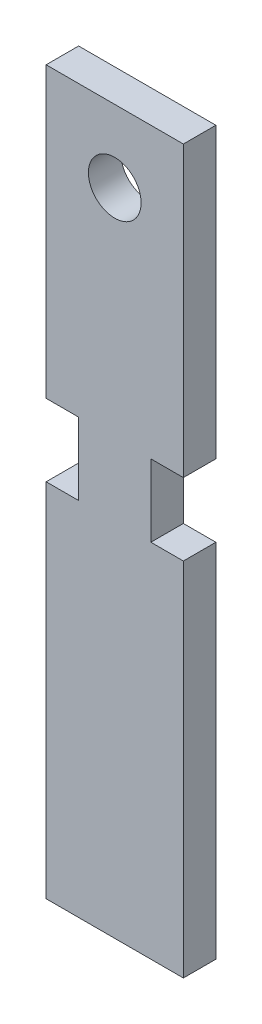
ISO-10303-21;
HEADER;
FILE_DESCRIPTION(('STEP AP214'),'2;1');
FILE_NAME('part.step','',(''),(''),'','','');
FILE_SCHEMA(('AUTOMOTIVE_DESIGN { 1 0 10303 214 1 1 1 1 }'));
ENDSEC;
DATA;
#1=APPLICATION_CONTEXT('core data for automotive mechanical design processes');
#2=APPLICATION_PROTOCOL_DEFINITION('international standard','automotive_design',2000,#1);
#3=PRODUCT_CONTEXT('',#1,'mechanical');
#4=PRODUCT('Part','Part','',(#3));
#5=PRODUCT_RELATED_PRODUCT_CATEGORY('part','',(#4));
#6=PRODUCT_DEFINITION_FORMATION('','',#4);
#7=PRODUCT_DEFINITION_CONTEXT('part definition',#1,'design');
#8=PRODUCT_DEFINITION('design','',#6,#7);
#9=PRODUCT_DEFINITION_SHAPE('','',#8);
#10=(LENGTH_UNIT() NAMED_UNIT(*) SI_UNIT(.MILLI.,.METRE.));
#11=(NAMED_UNIT(*) PLANE_ANGLE_UNIT() SI_UNIT($,.RADIAN.));
#12=(NAMED_UNIT(*) SI_UNIT($,.STERADIAN.) SOLID_ANGLE_UNIT());
#13=UNCERTAINTY_MEASURE_WITH_UNIT(LENGTH_MEASURE(1.E-05),#10,'distance_accuracy_value','');
#14=(GEOMETRIC_REPRESENTATION_CONTEXT(3) GLOBAL_UNCERTAINTY_ASSIGNED_CONTEXT((#13)) GLOBAL_UNIT_ASSIGNED_CONTEXT((#10,
#11,#12)) REPRESENTATION_CONTEXT('',''));
#15=CARTESIAN_POINT('',(0.,0.,0.));
#16=DIRECTION('',(0.,0.,1.));
#17=DIRECTION('',(1.,0.,0.));
#18=AXIS2_PLACEMENT_3D('',#15,#16,#17);
#19=CARTESIAN_POINT('',(-25.4,63.5,5.715));
#20=DIRECTION('',(0.,-1.,0.));
#21=DIRECTION('',(1.,0.,0.));
#22=AXIS2_PLACEMENT_3D('',#19,#20,#21);
#23=PLANE('',#22);
#24=DIRECTION('',(0.,0.,1.));
#25=VECTOR('',#24,1.);
#26=CARTESIAN_POINT('',(-12.065,63.5,0.));
#27=LINE('',#26,#25);
#28=CARTESIAN_POINT('',(-12.065,63.5,0.));
#29=VERTEX_POINT('',#28);
#30=CARTESIAN_POINT('',(-12.065,63.5,5.715));
#31=VERTEX_POINT('',#30);
#32=EDGE_CURVE('E135',#29,#31,#27,.T.);
#33=ORIENTED_EDGE('',*,*,#32,.T.);
#34=DIRECTION('',(-1.,0.,0.));
#35=VECTOR('',#34,1.);
#36=CARTESIAN_POINT('',(-25.4,63.5,5.715));
#37=LINE('',#36,#35);
#38=CARTESIAN_POINT('',(12.065,63.5,5.715));
#39=VERTEX_POINT('',#38);
#40=EDGE_CURVE('E54',#39,#31,#37,.T.);
#41=ORIENTED_EDGE('',*,*,#40,.F.);
#42=DIRECTION('',(0.,0.,1.));
#43=VECTOR('',#42,1.);
#44=CARTESIAN_POINT('',(12.065,63.5,0.));
#45=LINE('',#44,#43);
#46=CARTESIAN_POINT('',(12.065,63.5,0.));
#47=VERTEX_POINT('',#46);
#48=EDGE_CURVE('E163',#47,#39,#45,.T.);
#49=ORIENTED_EDGE('',*,*,#48,.F.);
#50=DIRECTION('',(-1.,0.,0.));
#51=VECTOR('',#50,1.);
#52=CARTESIAN_POINT('',(-25.4,63.5,0.));
#53=LINE('',#52,#51);
#54=EDGE_CURVE('E155',#47,#29,#53,.T.);
#55=ORIENTED_EDGE('',*,*,#54,.T.);
#56=EDGE_LOOP('',(#33,#41,#49,#55));
#57=FACE_BOUND('',#56,.T.);
#58=ADVANCED_FACE('F45',(#57),#23,.F.);
#59=CARTESIAN_POINT('',(-25.4,-63.5,5.715));
#60=DIRECTION('',(0.,1.,0.));
#61=DIRECTION('',(-1.,0.,0.));
#62=AXIS2_PLACEMENT_3D('',#59,#60,#61);
#63=PLANE('',#62);
#64=DIRECTION('',(0.,0.,1.));
#65=VECTOR('',#64,1.);
#66=CARTESIAN_POINT('',(-12.065,-63.5,0.));
#67=LINE('',#66,#65);
#68=CARTESIAN_POINT('',(-12.065,-63.5,0.));
#69=VERTEX_POINT('',#68);
#70=CARTESIAN_POINT('',(-12.065,-63.5,5.715));
#71=VERTEX_POINT('',#70);
#72=EDGE_CURVE('E147',#69,#71,#67,.T.);
#73=ORIENTED_EDGE('',*,*,#72,.F.);
#74=DIRECTION('',(1.,0.,0.));
#75=VECTOR('',#74,1.);
#76=CARTESIAN_POINT('',(-25.4,-63.5,0.));
#77=LINE('',#76,#75);
#78=CARTESIAN_POINT('',(12.065,-63.5,0.));
#79=VERTEX_POINT('',#78);
#80=EDGE_CURVE('E48',#69,#79,#77,.T.);
#81=ORIENTED_EDGE('',*,*,#80,.T.);
#82=DIRECTION('',(0.,0.,1.));
#83=VECTOR('',#82,1.);
#84=CARTESIAN_POINT('',(12.065,-63.5,0.));
#85=LINE('',#84,#83);
#86=CARTESIAN_POINT('',(12.065,-63.5,5.715));
#87=VERTEX_POINT('',#86);
#88=EDGE_CURVE('E250',#79,#87,#85,.T.);
#89=ORIENTED_EDGE('',*,*,#88,.T.);
#90=DIRECTION('',(1.,0.,0.));
#91=VECTOR('',#90,1.);
#92=CARTESIAN_POINT('',(-25.4,-63.5,5.715));
#93=LINE('',#92,#91);
#94=EDGE_CURVE('E11',#71,#87,#93,.T.);
#95=ORIENTED_EDGE('',*,*,#94,.F.);
#96=EDGE_LOOP('',(#73,#81,#89,#95));
#97=FACE_BOUND('',#96,.T.);
#98=ADVANCED_FACE('F281',(#97),#63,.F.);
#99=CARTESIAN_POINT('',(0.,0.,5.715));
#100=DIRECTION('',(0.,0.,-1.));
#101=DIRECTION('',(-1.,0.,0.));
#102=AXIS2_PLACEMENT_3D('',#99,#100,#101);
#103=PLANE('',#102);
#104=CARTESIAN_POINT('',(0.,50.8,5.715));
#105=DIRECTION('',(0.,0.,1.));
#106=DIRECTION('',(1.,0.,0.));
#107=AXIS2_PLACEMENT_3D('',#104,#105,#106);
#108=CIRCLE('',#107,4.6355);
#109=CARTESIAN_POINT('',(4.6355,50.8,5.715));
#110=VERTEX_POINT('',#109);
#111=EDGE_CURVE('E172',#110,#110,#108,.T.);
#112=ORIENTED_EDGE('',*,*,#111,.F.);
#113=EDGE_LOOP('',(#112));
#114=FACE_BOUND('',#113,.T.);
#115=DIRECTION('',(0.,-1.,0.));
#116=VECTOR('',#115,1.);
#117=CARTESIAN_POINT('',(-12.065,0.,5.715));
#118=LINE('',#117,#116);
#119=CARTESIAN_POINT('',(-12.065,0.,5.715));
#120=VERTEX_POINT('',#119);
#121=EDGE_CURVE('E255',#120,#71,#118,.T.);
#122=ORIENTED_EDGE('',*,*,#121,.T.);
#123=ORIENTED_EDGE('',*,*,#94,.T.);
#124=DIRECTION('',(0.,-1.,0.));
#125=VECTOR('',#124,1.);
#126=CARTESIAN_POINT('',(12.065,0.,5.715));
#127=LINE('',#126,#125);
#128=CARTESIAN_POINT('',(12.065,0.,5.715));
#129=VERTEX_POINT('',#128);
#130=EDGE_CURVE('E259',#129,#87,#127,.T.);
#131=ORIENTED_EDGE('',*,*,#130,.F.);
#132=DIRECTION('',(1.,0.,0.));
#133=VECTOR('',#132,1.);
#134=CARTESIAN_POINT('',(12.065,0.,5.715));
#135=LINE('',#134,#133);
#136=CARTESIAN_POINT('',(6.34999999999999,0.,5.715));
#137=VERTEX_POINT('',#136);
#138=EDGE_CURVE('E181',#137,#129,#135,.T.);
#139=ORIENTED_EDGE('',*,*,#138,.F.);
#140=DIRECTION('',(0.,-1.,0.));
#141=VECTOR('',#140,1.);
#142=CARTESIAN_POINT('',(6.34999999999999,0.,5.715));
#143=LINE('',#142,#141);
#144=CARTESIAN_POINT('',(6.34999999999999,12.7,5.715));
#145=VERTEX_POINT('',#144);
#146=EDGE_CURVE('E196',#145,#137,#143,.T.);
#147=ORIENTED_EDGE('',*,*,#146,.F.);
#148=DIRECTION('',(-1.,0.,0.));
#149=VECTOR('',#148,1.);
#150=CARTESIAN_POINT('',(12.065,12.7,5.715));
#151=LINE('',#150,#149);
#152=CARTESIAN_POINT('',(12.065,12.7,5.715));
#153=VERTEX_POINT('',#152);
#154=EDGE_CURVE('E191',#153,#145,#151,.T.);
#155=ORIENTED_EDGE('',*,*,#154,.F.);
#156=EDGE_CURVE('E70',#39,#153,#127,.T.);
#157=ORIENTED_EDGE('',*,*,#156,.F.);
#158=ORIENTED_EDGE('',*,*,#40,.T.);
#159=CARTESIAN_POINT('',(-12.065,12.7,5.715));
#160=VERTEX_POINT('',#159);
#161=EDGE_CURVE('E141',#31,#160,#118,.T.);
#162=ORIENTED_EDGE('',*,*,#161,.T.);
#163=DIRECTION('',(-1.,0.,0.));
#164=VECTOR('',#163,1.);
#165=CARTESIAN_POINT('',(-12.065,12.7,5.715));
#166=LINE('',#165,#164);
#167=CARTESIAN_POINT('',(-6.34999999999999,12.7,5.715));
#168=VERTEX_POINT('',#167);
#169=EDGE_CURVE('E227',#168,#160,#166,.T.);
#170=ORIENTED_EDGE('',*,*,#169,.F.);
#171=DIRECTION('',(0.,1.,0.));
#172=VECTOR('',#171,1.);
#173=CARTESIAN_POINT('',(-6.34999999999999,0.,5.715));
#174=LINE('',#173,#172);
#175=CARTESIAN_POINT('',(-6.34999999999999,0.,5.715));
#176=VERTEX_POINT('',#175);
#177=EDGE_CURVE('E62',#176,#168,#174,.T.);
#178=ORIENTED_EDGE('',*,*,#177,.F.);
#179=DIRECTION('',(1.,0.,0.));
#180=VECTOR('',#179,1.);
#181=CARTESIAN_POINT('',(-12.065,0.,5.715));
#182=LINE('',#181,#180);
#183=EDGE_CURVE('E217',#120,#176,#182,.T.);
#184=ORIENTED_EDGE('',*,*,#183,.F.);
#185=EDGE_LOOP('',(#122,#123,#131,#139,#147,#155,#157,#158,#162,#170,#178,#184));
#186=FACE_BOUND('',#185,.T.);
#187=ADVANCED_FACE('F276',(#114,#186),#103,.F.);
#188=CARTESIAN_POINT('',(0.,0.,0.));
#189=DIRECTION('',(0.,0.,-1.));
#190=DIRECTION('',(-1.,0.,0.));
#191=AXIS2_PLACEMENT_3D('',#188,#189,#190);
#192=PLANE('',#191);
#193=CARTESIAN_POINT('',(0.,50.8,0.));
#194=DIRECTION('',(0.,0.,1.));
#195=DIRECTION('',(1.,0.,0.));
#196=AXIS2_PLACEMENT_3D('',#193,#194,#195);
#197=CIRCLE('',#196,4.6355);
#198=CARTESIAN_POINT('',(4.6355,50.8,0.));
#199=VERTEX_POINT('',#198);
#200=EDGE_CURVE('E165',#199,#199,#197,.T.);
#201=ORIENTED_EDGE('',*,*,#200,.T.);
#202=EDGE_LOOP('',(#201));
#203=FACE_BOUND('',#202,.T.);
#204=ORIENTED_EDGE('',*,*,#80,.F.);
#205=DIRECTION('',(0.,-1.,0.));
#206=VECTOR('',#205,1.);
#207=CARTESIAN_POINT('',(-12.065,0.,0.));
#208=LINE('',#207,#206);
#209=CARTESIAN_POINT('',(-12.065,0.,0.));
#210=VERTEX_POINT('',#209);
#211=EDGE_CURVE('E160',#210,#69,#208,.T.);
#212=ORIENTED_EDGE('',*,*,#211,.F.);
#213=DIRECTION('',(1.,0.,0.));
#214=VECTOR('',#213,1.);
#215=CARTESIAN_POINT('',(-12.065,0.,0.));
#216=LINE('',#215,#214);
#217=CARTESIAN_POINT('',(-6.34999999999999,0.,0.));
#218=VERTEX_POINT('',#217);
#219=EDGE_CURVE('E220',#210,#218,#216,.T.);
#220=ORIENTED_EDGE('',*,*,#219,.T.);
#221=DIRECTION('',(0.,1.,0.));
#222=VECTOR('',#221,1.);
#223=CARTESIAN_POINT('',(-6.34999999999999,0.,0.));
#224=LINE('',#223,#222);
#225=CARTESIAN_POINT('',(-6.34999999999999,12.7,0.));
#226=VERTEX_POINT('',#225);
#227=EDGE_CURVE('E214',#218,#226,#224,.T.);
#228=ORIENTED_EDGE('',*,*,#227,.T.);
#229=DIRECTION('',(-1.,0.,0.));
#230=VECTOR('',#229,1.);
#231=CARTESIAN_POINT('',(-12.065,12.7,0.));
#232=LINE('',#231,#230);
#233=CARTESIAN_POINT('',(-12.065,12.7,0.));
#234=VERTEX_POINT('',#233);
#235=EDGE_CURVE('E158',#226,#234,#232,.T.);
#236=ORIENTED_EDGE('',*,*,#235,.T.);
#237=EDGE_CURVE('E138',#29,#234,#208,.T.);
#238=ORIENTED_EDGE('',*,*,#237,.F.);
#239=ORIENTED_EDGE('',*,*,#54,.F.);
#240=DIRECTION('',(0.,-1.,0.));
#241=VECTOR('',#240,1.);
#242=CARTESIAN_POINT('',(12.065,0.,0.));
#243=LINE('',#242,#241);
#244=CARTESIAN_POINT('',(12.065,12.7,0.));
#245=VERTEX_POINT('',#244);
#246=EDGE_CURVE('E251',#47,#245,#243,.T.);
#247=ORIENTED_EDGE('',*,*,#246,.T.);
#248=DIRECTION('',(-1.,0.,0.));
#249=VECTOR('',#248,1.);
#250=CARTESIAN_POINT('',(12.065,12.7,0.));
#251=LINE('',#250,#249);
#252=CARTESIAN_POINT('',(6.34999999999999,12.7,0.));
#253=VERTEX_POINT('',#252);
#254=EDGE_CURVE('E177',#245,#253,#251,.T.);
#255=ORIENTED_EDGE('',*,*,#254,.T.);
#256=DIRECTION('',(0.,-1.,0.));
#257=VECTOR('',#256,1.);
#258=CARTESIAN_POINT('',(6.34999999999999,0.,0.));
#259=LINE('',#258,#257);
#260=CARTESIAN_POINT('',(6.34999999999999,0.,0.));
#261=VERTEX_POINT('',#260);
#262=EDGE_CURVE('E182',#253,#261,#259,.T.);
#263=ORIENTED_EDGE('',*,*,#262,.T.);
#264=DIRECTION('',(1.,0.,0.));
#265=VECTOR('',#264,1.);
#266=CARTESIAN_POINT('',(12.065,0.,0.));
#267=LINE('',#266,#265);
#268=CARTESIAN_POINT('',(12.065,0.,0.));
#269=VERTEX_POINT('',#268);
#270=EDGE_CURVE('E186',#261,#269,#267,.T.);
#271=ORIENTED_EDGE('',*,*,#270,.T.);
#272=EDGE_CURVE('E258',#269,#79,#243,.T.);
#273=ORIENTED_EDGE('',*,*,#272,.T.);
#274=EDGE_LOOP('',(#204,#212,#220,#228,#236,#238,#239,#247,#255,#263,#271,#273));
#275=FACE_BOUND('',#274,.T.);
#276=ADVANCED_FACE('F153',(#203,#275),#192,.T.);
#277=CARTESIAN_POINT('',(12.065,0.,0.));
#278=DIRECTION('',(0.,-1.,0.));
#279=DIRECTION('',(0.,0.,-1.));
#280=AXIS2_PLACEMENT_3D('',#277,#278,#279);
#281=PLANE('',#280);
#282=ORIENTED_EDGE('',*,*,#138,.T.);
#283=DIRECTION('',(0.,0.,1.));
#284=VECTOR('',#283,1.);
#285=CARTESIAN_POINT('',(12.065,0.,0.));
#286=LINE('',#285,#284);
#287=EDGE_CURVE('E203',#269,#129,#286,.T.);
#288=ORIENTED_EDGE('',*,*,#287,.F.);
#289=ORIENTED_EDGE('',*,*,#270,.F.);
#290=DIRECTION('',(0.,0.,1.));
#291=VECTOR('',#290,1.);
#292=CARTESIAN_POINT('',(6.34999999999999,0.,0.));
#293=LINE('',#292,#291);
#294=EDGE_CURVE('E206',#261,#137,#293,.T.);
#295=ORIENTED_EDGE('',*,*,#294,.T.);
#296=EDGE_LOOP('',(#282,#288,#289,#295));
#297=FACE_BOUND('',#296,.T.);
#298=ADVANCED_FACE('F361',(#297),#281,.F.);
#299=CARTESIAN_POINT('',(6.34999999999999,0.,0.));
#300=DIRECTION('',(-1.,0.,0.));
#301=DIRECTION('',(0.,0.,1.));
#302=AXIS2_PLACEMENT_3D('',#299,#300,#301);
#303=PLANE('',#302);
#304=ORIENTED_EDGE('',*,*,#146,.T.);
#305=ORIENTED_EDGE('',*,*,#294,.F.);
#306=ORIENTED_EDGE('',*,*,#262,.F.);
#307=DIRECTION('',(0.,0.,1.));
#308=VECTOR('',#307,1.);
#309=CARTESIAN_POINT('',(6.34999999999999,12.7,0.));
#310=LINE('',#309,#308);
#311=EDGE_CURVE('E209',#253,#145,#310,.T.);
#312=ORIENTED_EDGE('',*,*,#311,.T.);
#313=EDGE_LOOP('',(#304,#305,#306,#312));
#314=FACE_BOUND('',#313,.T.);
#315=ADVANCED_FACE('F366',(#314),#303,.F.);
#316=CARTESIAN_POINT('',(12.065,12.7,0.));
#317=DIRECTION('',(0.,1.,0.));
#318=DIRECTION('',(0.,0.,1.));
#319=AXIS2_PLACEMENT_3D('',#316,#317,#318);
#320=PLANE('',#319);
#321=ORIENTED_EDGE('',*,*,#154,.T.);
#322=ORIENTED_EDGE('',*,*,#311,.F.);
#323=ORIENTED_EDGE('',*,*,#254,.F.);
#324=DIRECTION('',(0.,0.,1.));
#325=VECTOR('',#324,1.);
#326=CARTESIAN_POINT('',(12.065,12.7,0.));
#327=LINE('',#326,#325);
#328=EDGE_CURVE('E190',#245,#153,#327,.T.);
#329=ORIENTED_EDGE('',*,*,#328,.T.);
#330=EDGE_LOOP('',(#321,#322,#323,#329));
#331=FACE_BOUND('',#330,.T.);
#332=ADVANCED_FACE('F370',(#331),#320,.F.);
#333=CARTESIAN_POINT('',(-6.34999999999999,0.,0.));
#334=DIRECTION('',(1.,0.,0.));
#335=DIRECTION('',(0.,0.,-1.));
#336=AXIS2_PLACEMENT_3D('',#333,#334,#335);
#337=PLANE('',#336);
#338=ORIENTED_EDGE('',*,*,#177,.T.);
#339=DIRECTION('',(0.,0.,1.));
#340=VECTOR('',#339,1.);
#341=CARTESIAN_POINT('',(-6.34999999999999,12.7,0.));
#342=LINE('',#341,#340);
#343=EDGE_CURVE('E224',#226,#168,#342,.T.);
#344=ORIENTED_EDGE('',*,*,#343,.F.);
#345=ORIENTED_EDGE('',*,*,#227,.F.);
#346=DIRECTION('',(0.,0.,1.));
#347=VECTOR('',#346,1.);
#348=CARTESIAN_POINT('',(-6.34999999999999,0.,0.));
#349=LINE('',#348,#347);
#350=EDGE_CURVE('E195',#218,#176,#349,.T.);
#351=ORIENTED_EDGE('',*,*,#350,.T.);
#352=EDGE_LOOP('',(#338,#344,#345,#351));
#353=FACE_BOUND('',#352,.T.);
#354=ADVANCED_FACE('F400',(#353),#337,.F.);
#355=CARTESIAN_POINT('',(-12.065,0.,0.));
#356=DIRECTION('',(0.,-1.,0.));
#357=DIRECTION('',(0.,0.,-1.));
#358=AXIS2_PLACEMENT_3D('',#355,#356,#357);
#359=PLANE('',#358);
#360=ORIENTED_EDGE('',*,*,#183,.T.);
#361=ORIENTED_EDGE('',*,*,#350,.F.);
#362=ORIENTED_EDGE('',*,*,#219,.F.);
#363=DIRECTION('',(0.,0.,1.));
#364=VECTOR('',#363,1.);
#365=CARTESIAN_POINT('',(-12.065,0.,0.));
#366=LINE('',#365,#364);
#367=EDGE_CURVE('E236',#210,#120,#366,.T.);
#368=ORIENTED_EDGE('',*,*,#367,.T.);
#369=EDGE_LOOP('',(#360,#361,#362,#368));
#370=FACE_BOUND('',#369,.T.);
#371=ADVANCED_FACE('F401',(#370),#359,.F.);
#372=CARTESIAN_POINT('',(-12.065,12.7,0.));
#373=DIRECTION('',(0.,1.,0.));
#374=DIRECTION('',(0.,0.,1.));
#375=AXIS2_PLACEMENT_3D('',#372,#373,#374);
#376=PLANE('',#375);
#377=ORIENTED_EDGE('',*,*,#169,.T.);
#378=DIRECTION('',(0.,0.,1.));
#379=VECTOR('',#378,1.);
#380=CARTESIAN_POINT('',(-12.065,12.7,0.));
#381=LINE('',#380,#379);
#382=EDGE_CURVE('E240',#234,#160,#381,.T.);
#383=ORIENTED_EDGE('',*,*,#382,.F.);
#384=ORIENTED_EDGE('',*,*,#235,.F.);
#385=ORIENTED_EDGE('',*,*,#343,.T.);
#386=EDGE_LOOP('',(#377,#383,#384,#385));
#387=FACE_BOUND('',#386,.T.);
#388=ADVANCED_FACE('F404',(#387),#376,.F.);
#389=CARTESIAN_POINT('',(0.,50.8,0.));
#390=DIRECTION('',(0.,0.,1.));
#391=DIRECTION('',(1.,0.,0.));
#392=AXIS2_PLACEMENT_3D('',#389,#390,#391);
#393=CYLINDRICAL_SURFACE('',#392,4.6355);
#394=ORIENTED_EDGE('',*,*,#200,.F.);
#395=EDGE_LOOP('',(#394));
#396=FACE_BOUND('',#395,.T.);
#397=ORIENTED_EDGE('',*,*,#111,.T.);
#398=EDGE_LOOP('',(#397));
#399=FACE_BOUND('',#398,.T.);
#400=ADVANCED_FACE('F408',(#396,#399),#393,.F.);
#401=CARTESIAN_POINT('',(-12.065,0.,0.));
#402=DIRECTION('',(-1.,0.,0.));
#403=DIRECTION('',(0.,-1.,0.));
#404=AXIS2_PLACEMENT_3D('',#401,#402,#403);
#405=PLANE('',#404);
#406=ORIENTED_EDGE('',*,*,#382,.T.);
#407=ORIENTED_EDGE('',*,*,#161,.F.);
#408=ORIENTED_EDGE('',*,*,#32,.F.);
#409=ORIENTED_EDGE('',*,*,#237,.T.);
#410=EDGE_LOOP('',(#406,#407,#408,#409));
#411=FACE_BOUND('',#410,.T.);
#412=ADVANCED_FACE('F137',(#411),#405,.T.);
#413=ORIENTED_EDGE('',*,*,#367,.F.);
#414=ORIENTED_EDGE('',*,*,#211,.T.);
#415=ORIENTED_EDGE('',*,*,#72,.T.);
#416=ORIENTED_EDGE('',*,*,#121,.F.);
#417=EDGE_LOOP('',(#413,#414,#415,#416));
#418=FACE_BOUND('',#417,.T.);
#419=ADVANCED_FACE('F373',(#418),#405,.T.);
#420=CARTESIAN_POINT('',(12.065,0.,0.));
#421=DIRECTION('',(-1.,0.,0.));
#422=DIRECTION('',(0.,-1.,0.));
#423=AXIS2_PLACEMENT_3D('',#420,#421,#422);
#424=PLANE('',#423);
#425=ORIENTED_EDGE('',*,*,#246,.F.);
#426=ORIENTED_EDGE('',*,*,#48,.T.);
#427=ORIENTED_EDGE('',*,*,#156,.T.);
#428=ORIENTED_EDGE('',*,*,#328,.F.);
#429=EDGE_LOOP('',(#425,#426,#427,#428));
#430=FACE_BOUND('',#429,.T.);
#431=ADVANCED_FACE('F371',(#430),#424,.F.);
#432=ORIENTED_EDGE('',*,*,#130,.T.);
#433=ORIENTED_EDGE('',*,*,#88,.F.);
#434=ORIENTED_EDGE('',*,*,#272,.F.);
#435=ORIENTED_EDGE('',*,*,#287,.T.);
#436=EDGE_LOOP('',(#432,#433,#434,#435));
#437=FACE_BOUND('',#436,.T.);
#438=ADVANCED_FACE('F284',(#437),#424,.F.);
#439=CLOSED_SHELL('',(#58,#98,#187,#276,#298,#315,#332,#354,#371,#388,#400,#412,#419,#431,#438));
#440=MANIFOLD_SOLID_BREP('B2',#439);
#441=ADVANCED_BREP_SHAPE_REPRESENTATION('',(#18,#440),#14);
#442=SHAPE_DEFINITION_REPRESENTATION(#9,#441);
ENDSEC;
END-ISO-10303-21;
